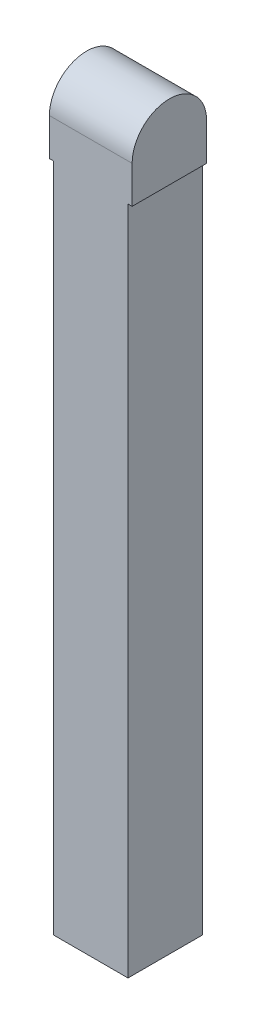
ISO-10303-21;
HEADER;
FILE_DESCRIPTION(('STEP AP214'),'2;1');
FILE_NAME('part.step','',(''),(''),'','','');
FILE_SCHEMA(('AUTOMOTIVE_DESIGN { 1 0 10303 214 1 1 1 1 }'));
ENDSEC;
DATA;
#1=APPLICATION_CONTEXT('core data for automotive mechanical design processes');
#2=APPLICATION_PROTOCOL_DEFINITION('international standard','automotive_design',2000,#1);
#3=PRODUCT_CONTEXT('',#1,'mechanical');
#4=PRODUCT('Part','Part','',(#3));
#5=PRODUCT_RELATED_PRODUCT_CATEGORY('part','',(#4));
#6=PRODUCT_DEFINITION_FORMATION('','',#4);
#7=PRODUCT_DEFINITION_CONTEXT('part definition',#1,'design');
#8=PRODUCT_DEFINITION('design','',#6,#7);
#9=PRODUCT_DEFINITION_SHAPE('','',#8);
#10=(LENGTH_UNIT() NAMED_UNIT(*) SI_UNIT(.MILLI.,.METRE.));
#11=(NAMED_UNIT(*) PLANE_ANGLE_UNIT() SI_UNIT($,.RADIAN.));
#12=(NAMED_UNIT(*) SI_UNIT($,.STERADIAN.) SOLID_ANGLE_UNIT());
#13=UNCERTAINTY_MEASURE_WITH_UNIT(LENGTH_MEASURE(1.E-05),#10,'distance_accuracy_value','');
#14=(GEOMETRIC_REPRESENTATION_CONTEXT(3) GLOBAL_UNCERTAINTY_ASSIGNED_CONTEXT((#13)) GLOBAL_UNIT_ASSIGNED_CONTEXT((#10,
#11,#12)) REPRESENTATION_CONTEXT('',''));
#15=CARTESIAN_POINT('',(0.,0.,0.));
#16=DIRECTION('',(0.,0.,1.));
#17=DIRECTION('',(1.,0.,0.));
#18=AXIS2_PLACEMENT_3D('',#15,#16,#17);
#19=CARTESIAN_POINT('',(-9.,160.,9.));
#20=DIRECTION('',(0.,0.,-1.));
#21=DIRECTION('',(-1.,0.,0.));
#22=AXIS2_PLACEMENT_3D('',#19,#20,#21);
#23=PLANE('',#22);
#24=DIRECTION('',(-1.,0.,0.));
#25=VECTOR('',#24,1.);
#26=CARTESIAN_POINT('',(10.,171.,9.00000000000001));
#27=LINE('',#26,#25);
#28=CARTESIAN_POINT('',(10.,171.,9.));
#29=VERTEX_POINT('',#28);
#30=CARTESIAN_POINT('',(-10.,171.,9.00000000000001));
#31=VERTEX_POINT('',#30);
#32=EDGE_CURVE('E49',#29,#31,#27,.T.);
#33=ORIENTED_EDGE('',*,*,#32,.T.);
#34=DIRECTION('',(0.,-1.,0.));
#35=VECTOR('',#34,1.);
#36=CARTESIAN_POINT('',(-10.,180.,9.));
#37=LINE('',#36,#35);
#38=CARTESIAN_POINT('',(-10.,162.,9.));
#39=VERTEX_POINT('',#38);
#40=EDGE_CURVE('E122',#31,#39,#37,.T.);
#41=ORIENTED_EDGE('',*,*,#40,.T.);
#42=DIRECTION('',(1.,0.,0.));
#43=VECTOR('',#42,1.);
#44=CARTESIAN_POINT('',(-10.,162.,9.));
#45=LINE('',#44,#43);
#46=CARTESIAN_POINT('',(-9.,162.,9.));
#47=VERTEX_POINT('',#46);
#48=EDGE_CURVE('E167',#39,#47,#45,.T.);
#49=ORIENTED_EDGE('',*,*,#48,.T.);
#50=DIRECTION('',(0.,-1.,0.));
#51=VECTOR('',#50,1.);
#52=CARTESIAN_POINT('',(-9.,160.,9.));
#53=LINE('',#52,#51);
#54=CARTESIAN_POINT('',(-9.,0.,9.));
#55=VERTEX_POINT('',#54);
#56=EDGE_CURVE('E11',#47,#55,#53,.T.);
#57=ORIENTED_EDGE('',*,*,#56,.T.);
#58=DIRECTION('',(1.,0.,0.));
#59=VECTOR('',#58,1.);
#60=CARTESIAN_POINT('',(-9.,0.,9.));
#61=LINE('',#60,#59);
#62=CARTESIAN_POINT('',(9.,0.,9.));
#63=VERTEX_POINT('',#62);
#64=EDGE_CURVE('E138',#55,#63,#61,.T.);
#65=ORIENTED_EDGE('',*,*,#64,.T.);
#66=DIRECTION('',(0.,-1.,0.));
#67=VECTOR('',#66,1.);
#68=CARTESIAN_POINT('',(9.,160.,9.));
#69=LINE('',#68,#67);
#70=CARTESIAN_POINT('',(9.,162.,9.));
#71=VERTEX_POINT('',#70);
#72=EDGE_CURVE('E42',#71,#63,#69,.T.);
#73=ORIENTED_EDGE('',*,*,#72,.F.);
#74=CARTESIAN_POINT('',(10.,162.,9.));
#75=VERTEX_POINT('',#74);
#76=EDGE_CURVE('E170',#71,#75,#45,.T.);
#77=ORIENTED_EDGE('',*,*,#76,.T.);
#78=DIRECTION('',(0.,-1.,0.));
#79=VECTOR('',#78,1.);
#80=CARTESIAN_POINT('',(10.,180.,9.));
#81=LINE('',#80,#79);
#82=EDGE_CURVE('E120',#29,#75,#81,.T.);
#83=ORIENTED_EDGE('',*,*,#82,.F.);
#84=EDGE_LOOP('',(#33,#41,#49,#57,#65,#73,#77,#83));
#85=FACE_BOUND('',#84,.T.);
#86=ADVANCED_FACE('F34',(#85),#23,.F.);
#87=CARTESIAN_POINT('',(-9.,160.,-9.));
#88=DIRECTION('',(1.,0.,0.));
#89=DIRECTION('',(0.,0.,-1.));
#90=AXIS2_PLACEMENT_3D('',#87,#88,#89);
#91=PLANE('',#90);
#92=DIRECTION('',(0.,0.,1.));
#93=VECTOR('',#92,1.);
#94=CARTESIAN_POINT('',(-9.,0.,-9.));
#95=LINE('',#94,#93);
#96=CARTESIAN_POINT('',(-9.,0.,-9.));
#97=VERTEX_POINT('',#96);
#98=EDGE_CURVE('E135',#97,#55,#95,.T.);
#99=ORIENTED_EDGE('',*,*,#98,.T.);
#100=ORIENTED_EDGE('',*,*,#56,.F.);
#101=DIRECTION('',(0.,0.,1.));
#102=VECTOR('',#101,1.);
#103=CARTESIAN_POINT('',(-9.,162.,-9.));
#104=LINE('',#103,#102);
#105=CARTESIAN_POINT('',(-9.,162.,-9.));
#106=VERTEX_POINT('',#105);
#107=EDGE_CURVE('E129',#106,#47,#104,.T.);
#108=ORIENTED_EDGE('',*,*,#107,.F.);
#109=DIRECTION('',(0.,-1.,0.));
#110=VECTOR('',#109,1.);
#111=CARTESIAN_POINT('',(-9.,160.,-9.));
#112=LINE('',#111,#110);
#113=EDGE_CURVE('E143',#106,#97,#112,.T.);
#114=ORIENTED_EDGE('',*,*,#113,.T.);
#115=EDGE_LOOP('',(#99,#100,#108,#114));
#116=FACE_BOUND('',#115,.T.);
#117=ADVANCED_FACE('F36',(#116),#91,.F.);
#118=CARTESIAN_POINT('',(9.,160.,-9.));
#119=DIRECTION('',(-1.,0.,0.));
#120=DIRECTION('',(0.,0.,1.));
#121=AXIS2_PLACEMENT_3D('',#118,#119,#120);
#122=PLANE('',#121);
#123=DIRECTION('',(0.,0.,-1.));
#124=VECTOR('',#123,1.);
#125=CARTESIAN_POINT('',(9.,0.,-9.));
#126=LINE('',#125,#124);
#127=CARTESIAN_POINT('',(9.,0.,-9.));
#128=VERTEX_POINT('',#127);
#129=EDGE_CURVE('E140',#63,#128,#126,.T.);
#130=ORIENTED_EDGE('',*,*,#129,.T.);
#131=DIRECTION('',(0.,-1.,0.));
#132=VECTOR('',#131,1.);
#133=CARTESIAN_POINT('',(9.,160.,-9.));
#134=LINE('',#133,#132);
#135=CARTESIAN_POINT('',(9.,162.,-9.));
#136=VERTEX_POINT('',#135);
#137=EDGE_CURVE('E145',#136,#128,#134,.T.);
#138=ORIENTED_EDGE('',*,*,#137,.F.);
#139=DIRECTION('',(0.,0.,-1.));
#140=VECTOR('',#139,1.);
#141=CARTESIAN_POINT('',(9.,162.,-9.));
#142=LINE('',#141,#140);
#143=EDGE_CURVE('E132',#71,#136,#142,.T.);
#144=ORIENTED_EDGE('',*,*,#143,.F.);
#145=ORIENTED_EDGE('',*,*,#72,.T.);
#146=EDGE_LOOP('',(#130,#138,#144,#145));
#147=FACE_BOUND('',#146,.T.);
#148=ADVANCED_FACE('F150',(#147),#122,.F.);
#149=CARTESIAN_POINT('',(-9.,160.,-9.));
#150=DIRECTION('',(0.,0.,1.));
#151=DIRECTION('',(1.,0.,0.));
#152=AXIS2_PLACEMENT_3D('',#149,#150,#151);
#153=PLANE('',#152);
#154=DIRECTION('',(0.,-1.,0.));
#155=VECTOR('',#154,1.);
#156=CARTESIAN_POINT('',(-10.,180.,-9.));
#157=LINE('',#156,#155);
#158=CARTESIAN_POINT('',(-10.,171.,-9.));
#159=VERTEX_POINT('',#158);
#160=CARTESIAN_POINT('',(-10.,162.,-9.));
#161=VERTEX_POINT('',#160);
#162=EDGE_CURVE('E113',#159,#161,#157,.T.);
#163=ORIENTED_EDGE('',*,*,#162,.F.);
#164=DIRECTION('',(-1.,0.,0.));
#165=VECTOR('',#164,1.);
#166=CARTESIAN_POINT('',(10.,171.,-9.));
#167=LINE('',#166,#165);
#168=CARTESIAN_POINT('',(10.,171.,-9.));
#169=VERTEX_POINT('',#168);
#170=EDGE_CURVE('E100',#169,#159,#167,.T.);
#171=ORIENTED_EDGE('',*,*,#170,.F.);
#172=DIRECTION('',(0.,-1.,0.));
#173=VECTOR('',#172,1.);
#174=CARTESIAN_POINT('',(10.,180.,-9.));
#175=LINE('',#174,#173);
#176=CARTESIAN_POINT('',(10.,162.,-9.));
#177=VERTEX_POINT('',#176);
#178=EDGE_CURVE('E110',#169,#177,#175,.T.);
#179=ORIENTED_EDGE('',*,*,#178,.T.);
#180=DIRECTION('',(-1.,0.,0.));
#181=VECTOR('',#180,1.);
#182=CARTESIAN_POINT('',(-10.,162.,-9.));
#183=LINE('',#182,#181);
#184=EDGE_CURVE('E124',#177,#136,#183,.T.);
#185=ORIENTED_EDGE('',*,*,#184,.T.);
#186=ORIENTED_EDGE('',*,*,#137,.T.);
#187=DIRECTION('',(-1.,0.,0.));
#188=VECTOR('',#187,1.);
#189=CARTESIAN_POINT('',(-9.,0.,-9.));
#190=LINE('',#189,#188);
#191=EDGE_CURVE('E57',#128,#97,#190,.T.);
#192=ORIENTED_EDGE('',*,*,#191,.T.);
#193=ORIENTED_EDGE('',*,*,#113,.F.);
#194=EDGE_CURVE('E160',#106,#161,#183,.T.);
#195=ORIENTED_EDGE('',*,*,#194,.T.);
#196=EDGE_LOOP('',(#163,#171,#179,#185,#186,#192,#193,#195));
#197=FACE_BOUND('',#196,.T.);
#198=ADVANCED_FACE('F108',(#197),#153,.F.);
#199=CARTESIAN_POINT('',(0.,0.,0.));
#200=DIRECTION('',(0.,1.,0.));
#201=DIRECTION('',(0.,0.,1.));
#202=AXIS2_PLACEMENT_3D('',#199,#200,#201);
#203=PLANE('',#202);
#204=ORIENTED_EDGE('',*,*,#98,.F.);
#205=ORIENTED_EDGE('',*,*,#191,.F.);
#206=ORIENTED_EDGE('',*,*,#129,.F.);
#207=ORIENTED_EDGE('',*,*,#64,.F.);
#208=EDGE_LOOP('',(#204,#205,#206,#207));
#209=FACE_BOUND('',#208,.T.);
#210=ADVANCED_FACE('F156',(#209),#203,.F.);
#211=CARTESIAN_POINT('',(0.,162.,0.));
#212=DIRECTION('',(0.,1.,0.));
#213=DIRECTION('',(0.,0.,1.));
#214=AXIS2_PLACEMENT_3D('',#211,#212,#213);
#215=PLANE('',#214);
#216=ORIENTED_EDGE('',*,*,#194,.F.);
#217=ORIENTED_EDGE('',*,*,#107,.T.);
#218=ORIENTED_EDGE('',*,*,#48,.F.);
#219=DIRECTION('',(0.,0.,1.));
#220=VECTOR('',#219,1.);
#221=CARTESIAN_POINT('',(-10.,162.,-9.));
#222=LINE('',#221,#220);
#223=EDGE_CURVE('E114',#161,#39,#222,.T.);
#224=ORIENTED_EDGE('',*,*,#223,.F.);
#225=EDGE_LOOP('',(#216,#217,#218,#224));
#226=FACE_BOUND('',#225,.T.);
#227=ADVANCED_FACE('F165',(#226),#215,.F.);
#228=ORIENTED_EDGE('',*,*,#76,.F.);
#229=ORIENTED_EDGE('',*,*,#143,.T.);
#230=ORIENTED_EDGE('',*,*,#184,.F.);
#231=DIRECTION('',(0.,0.,-1.));
#232=VECTOR('',#231,1.);
#233=CARTESIAN_POINT('',(10.,162.,-9.));
#234=LINE('',#233,#232);
#235=EDGE_CURVE('E118',#75,#177,#234,.T.);
#236=ORIENTED_EDGE('',*,*,#235,.F.);
#237=EDGE_LOOP('',(#228,#229,#230,#236));
#238=FACE_BOUND('',#237,.T.);
#239=ADVANCED_FACE('F176',(#238),#215,.F.);
#240=CARTESIAN_POINT('',(-10.,180.,-9.));
#241=DIRECTION('',(1.,0.,0.));
#242=DIRECTION('',(0.,0.,-1.));
#243=AXIS2_PLACEMENT_3D('',#240,#241,#242);
#244=PLANE('',#243);
#245=ORIENTED_EDGE('',*,*,#40,.F.);
#246=CARTESIAN_POINT('',(-10.,171.,0.));
#247=DIRECTION('',(1.,0.,0.));
#248=DIRECTION('',(0.,0.,1.));
#249=AXIS2_PLACEMENT_3D('',#246,#247,#248);
#250=CIRCLE('',#249,9.);
#251=EDGE_CURVE('E105',#159,#31,#250,.T.);
#252=ORIENTED_EDGE('',*,*,#251,.F.);
#253=ORIENTED_EDGE('',*,*,#162,.T.);
#254=ORIENTED_EDGE('',*,*,#223,.T.);
#255=EDGE_LOOP('',(#245,#252,#253,#254));
#256=FACE_BOUND('',#255,.T.);
#257=ADVANCED_FACE('F177',(#256),#244,.F.);
#258=CARTESIAN_POINT('',(10.,180.,-9.));
#259=DIRECTION('',(-1.,0.,0.));
#260=DIRECTION('',(0.,0.,1.));
#261=AXIS2_PLACEMENT_3D('',#258,#259,#260);
#262=PLANE('',#261);
#263=ORIENTED_EDGE('',*,*,#178,.F.);
#264=CARTESIAN_POINT('',(10.,171.,0.));
#265=DIRECTION('',(1.,0.,0.));
#266=DIRECTION('',(0.,0.,1.));
#267=AXIS2_PLACEMENT_3D('',#264,#265,#266);
#268=CIRCLE('',#267,9.);
#269=EDGE_CURVE('E97',#169,#29,#268,.T.);
#270=ORIENTED_EDGE('',*,*,#269,.T.);
#271=ORIENTED_EDGE('',*,*,#82,.T.);
#272=ORIENTED_EDGE('',*,*,#235,.T.);
#273=EDGE_LOOP('',(#263,#270,#271,#272));
#274=FACE_BOUND('',#273,.T.);
#275=ADVANCED_FACE('F116',(#274),#262,.F.);
#276=CARTESIAN_POINT('',(10.,171.,0.));
#277=DIRECTION('',(-1.,0.,0.));
#278=DIRECTION('',(0.,0.,1.));
#279=AXIS2_PLACEMENT_3D('',#276,#277,#278);
#280=CYLINDRICAL_SURFACE('',#279,9.);
#281=ORIENTED_EDGE('',*,*,#251,.T.);
#282=ORIENTED_EDGE('',*,*,#32,.F.);
#283=ORIENTED_EDGE('',*,*,#269,.F.);
#284=ORIENTED_EDGE('',*,*,#170,.T.);
#285=EDGE_LOOP('',(#281,#282,#283,#284));
#286=FACE_BOUND('',#285,.T.);
#287=ADVANCED_FACE('F99',(#286),#280,.T.);
#288=CLOSED_SHELL('',(#86,#117,#148,#198,#210,#227,#239,#257,#275,#287));
#289=MANIFOLD_SOLID_BREP('B2',#288);
#290=ADVANCED_BREP_SHAPE_REPRESENTATION('',(#18,#289),#14);
#291=SHAPE_DEFINITION_REPRESENTATION(#9,#290);
ENDSEC;
END-ISO-10303-21;
